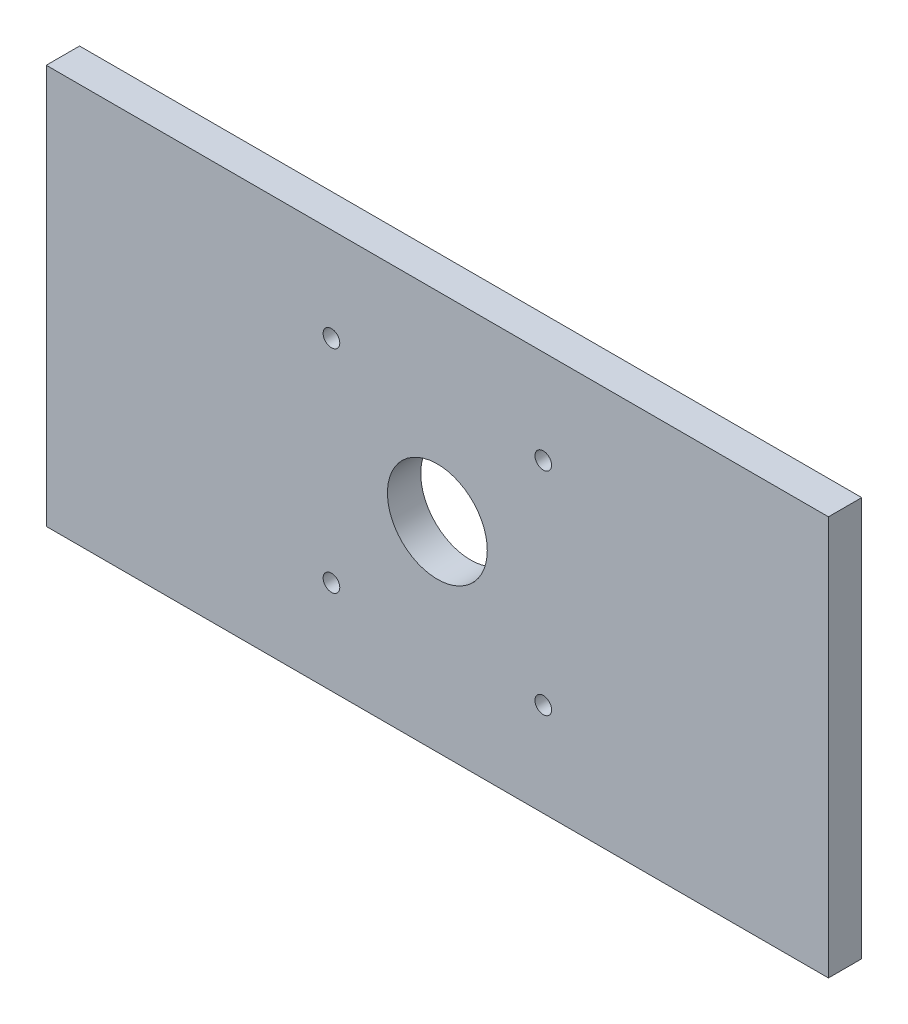
ISO-10303-21;
HEADER;
FILE_DESCRIPTION(('STEP AP214'),'2;1');
FILE_NAME('part.step','',(''),(''),'','','');
FILE_SCHEMA(('AUTOMOTIVE_DESIGN { 1 0 10303 214 1 1 1 1 }'));
ENDSEC;
DATA;
#1=APPLICATION_CONTEXT('core data for automotive mechanical design processes');
#2=APPLICATION_PROTOCOL_DEFINITION('international standard','automotive_design',2000,#1);
#3=PRODUCT_CONTEXT('',#1,'mechanical');
#4=PRODUCT('Part','Part','',(#3));
#5=PRODUCT_RELATED_PRODUCT_CATEGORY('part','',(#4));
#6=PRODUCT_DEFINITION_FORMATION('','',#4);
#7=PRODUCT_DEFINITION_CONTEXT('part definition',#1,'design');
#8=PRODUCT_DEFINITION('design','',#6,#7);
#9=PRODUCT_DEFINITION_SHAPE('','',#8);
#10=(LENGTH_UNIT() NAMED_UNIT(*) SI_UNIT(.MILLI.,.METRE.));
#11=(NAMED_UNIT(*) PLANE_ANGLE_UNIT() SI_UNIT($,.RADIAN.));
#12=(NAMED_UNIT(*) SI_UNIT($,.STERADIAN.) SOLID_ANGLE_UNIT());
#13=UNCERTAINTY_MEASURE_WITH_UNIT(LENGTH_MEASURE(1.E-05),#10,'distance_accuracy_value','');
#14=(GEOMETRIC_REPRESENTATION_CONTEXT(3) GLOBAL_UNCERTAINTY_ASSIGNED_CONTEXT((#13)) GLOBAL_UNIT_ASSIGNED_CONTEXT((#10,
#11,#12)) REPRESENTATION_CONTEXT('',''));
#15=CARTESIAN_POINT('',(0.,0.,0.));
#16=DIRECTION('',(0.,0.,1.));
#17=DIRECTION('',(1.,0.,0.));
#18=AXIS2_PLACEMENT_3D('',#15,#16,#17);
#19=CARTESIAN_POINT('',(117.5,-60.,10.));
#20=DIRECTION('',(-1.,0.,0.));
#21=DIRECTION('',(0.,0.,1.));
#22=AXIS2_PLACEMENT_3D('',#19,#20,#21);
#23=PLANE('',#22);
#24=DIRECTION('',(0.,1.,0.));
#25=VECTOR('',#24,1.);
#26=CARTESIAN_POINT('',(117.5,-60.,0.));
#27=LINE('',#26,#25);
#28=CARTESIAN_POINT('',(117.5,-60.,0.));
#29=VERTEX_POINT('',#28);
#30=CARTESIAN_POINT('',(117.5,60.,0.));
#31=VERTEX_POINT('',#30);
#32=EDGE_CURVE('E106',#29,#31,#27,.T.);
#33=ORIENTED_EDGE('',*,*,#32,.T.);
#34=DIRECTION('',(0.,0.,-1.));
#35=VECTOR('',#34,1.);
#36=CARTESIAN_POINT('',(117.5,60.,10.));
#37=LINE('',#36,#35);
#38=CARTESIAN_POINT('',(117.5,60.,10.));
#39=VERTEX_POINT('',#38);
#40=EDGE_CURVE('E11',#39,#31,#37,.T.);
#41=ORIENTED_EDGE('',*,*,#40,.F.);
#42=DIRECTION('',(0.,1.,0.));
#43=VECTOR('',#42,1.);
#44=CARTESIAN_POINT('',(117.5,-60.,10.));
#45=LINE('',#44,#43);
#46=CARTESIAN_POINT('',(117.5,-60.,10.));
#47=VERTEX_POINT('',#46);
#48=EDGE_CURVE('E90',#47,#39,#45,.T.);
#49=ORIENTED_EDGE('',*,*,#48,.F.);
#50=DIRECTION('',(0.,0.,-1.));
#51=VECTOR('',#50,1.);
#52=CARTESIAN_POINT('',(117.5,-60.,10.));
#53=LINE('',#52,#51);
#54=EDGE_CURVE('E102',#47,#29,#53,.T.);
#55=ORIENTED_EDGE('',*,*,#54,.T.);
#56=EDGE_LOOP('',(#33,#41,#49,#55));
#57=FACE_BOUND('',#56,.T.);
#58=ADVANCED_FACE('F38',(#57),#23,.F.);
#59=CARTESIAN_POINT('',(-117.5,60.,10.));
#60=DIRECTION('',(0.,-1.,0.));
#61=DIRECTION('',(0.,0.,-1.));
#62=AXIS2_PLACEMENT_3D('',#59,#60,#61);
#63=PLANE('',#62);
#64=DIRECTION('',(-1.,0.,0.));
#65=VECTOR('',#64,1.);
#66=CARTESIAN_POINT('',(-117.5,60.,0.));
#67=LINE('',#66,#65);
#68=CARTESIAN_POINT('',(-117.5,60.,0.));
#69=VERTEX_POINT('',#68);
#70=EDGE_CURVE('E95',#31,#69,#67,.T.);
#71=ORIENTED_EDGE('',*,*,#70,.T.);
#72=DIRECTION('',(0.,0.,-1.));
#73=VECTOR('',#72,1.);
#74=CARTESIAN_POINT('',(-117.5,60.,10.));
#75=LINE('',#74,#73);
#76=CARTESIAN_POINT('',(-117.5,60.,10.));
#77=VERTEX_POINT('',#76);
#78=EDGE_CURVE('E47',#77,#69,#75,.T.);
#79=ORIENTED_EDGE('',*,*,#78,.F.);
#80=DIRECTION('',(-1.,0.,0.));
#81=VECTOR('',#80,1.);
#82=CARTESIAN_POINT('',(-117.5,60.,10.));
#83=LINE('',#82,#81);
#84=EDGE_CURVE('E85',#39,#77,#83,.T.);
#85=ORIENTED_EDGE('',*,*,#84,.F.);
#86=ORIENTED_EDGE('',*,*,#40,.T.);
#87=EDGE_LOOP('',(#71,#79,#85,#86));
#88=FACE_BOUND('',#87,.T.);
#89=ADVANCED_FACE('F94',(#88),#63,.F.);
#90=CARTESIAN_POINT('',(-117.5,-60.,10.));
#91=DIRECTION('',(1.,0.,0.));
#92=DIRECTION('',(0.,0.,-1.));
#93=AXIS2_PLACEMENT_3D('',#90,#91,#92);
#94=PLANE('',#93);
#95=DIRECTION('',(0.,-1.,0.));
#96=VECTOR('',#95,1.);
#97=CARTESIAN_POINT('',(-117.5,-60.,0.));
#98=LINE('',#97,#96);
#99=CARTESIAN_POINT('',(-117.5,-60.,0.));
#100=VERTEX_POINT('',#99);
#101=EDGE_CURVE('E72',#69,#100,#98,.T.);
#102=ORIENTED_EDGE('',*,*,#101,.T.);
#103=DIRECTION('',(0.,0.,-1.));
#104=VECTOR('',#103,1.);
#105=CARTESIAN_POINT('',(-117.5,-60.,10.));
#106=LINE('',#105,#104);
#107=CARTESIAN_POINT('',(-117.5,-60.,10.));
#108=VERTEX_POINT('',#107);
#109=EDGE_CURVE('E97',#108,#100,#106,.T.);
#110=ORIENTED_EDGE('',*,*,#109,.F.);
#111=DIRECTION('',(0.,-1.,0.));
#112=VECTOR('',#111,1.);
#113=CARTESIAN_POINT('',(-117.5,-60.,10.));
#114=LINE('',#113,#112);
#115=EDGE_CURVE('E88',#77,#108,#114,.T.);
#116=ORIENTED_EDGE('',*,*,#115,.F.);
#117=ORIENTED_EDGE('',*,*,#78,.T.);
#118=EDGE_LOOP('',(#102,#110,#116,#117));
#119=FACE_BOUND('',#118,.T.);
#120=ADVANCED_FACE('F98',(#119),#94,.F.);
#121=CARTESIAN_POINT('',(-117.5,-60.,10.));
#122=DIRECTION('',(0.,1.,0.));
#123=DIRECTION('',(0.,0.,1.));
#124=AXIS2_PLACEMENT_3D('',#121,#122,#123);
#125=PLANE('',#124);
#126=DIRECTION('',(1.,0.,0.));
#127=VECTOR('',#126,1.);
#128=CARTESIAN_POINT('',(-117.5,-60.,0.));
#129=LINE('',#128,#127);
#130=EDGE_CURVE('E78',#100,#29,#129,.T.);
#131=ORIENTED_EDGE('',*,*,#130,.T.);
#132=ORIENTED_EDGE('',*,*,#54,.F.);
#133=DIRECTION('',(1.,0.,0.));
#134=VECTOR('',#133,1.);
#135=CARTESIAN_POINT('',(-117.5,-60.,10.));
#136=LINE('',#135,#134);
#137=EDGE_CURVE('E55',#108,#47,#136,.T.);
#138=ORIENTED_EDGE('',*,*,#137,.F.);
#139=ORIENTED_EDGE('',*,*,#109,.T.);
#140=EDGE_LOOP('',(#131,#132,#138,#139));
#141=FACE_BOUND('',#140,.T.);
#142=ADVANCED_FACE('F120',(#141),#125,.F.);
#143=CARTESIAN_POINT('',(0.,0.,10.));
#144=DIRECTION('',(0.,0.,-1.));
#145=DIRECTION('',(-1.,0.,0.));
#146=AXIS2_PLACEMENT_3D('',#143,#144,#145);
#147=PLANE('',#146);
#148=CARTESIAN_POINT('',(-31.8198051533935,31.8198051533919,10.));
#149=DIRECTION('',(0.,0.,1.));
#150=DIRECTION('',(1.,0.,0.));
#151=AXIS2_PLACEMENT_3D('',#148,#149,#150);
#152=CIRCLE('',#151,2.5);
#153=CARTESIAN_POINT('',(-29.3198051533935,31.8198051533919,10.));
#154=VERTEX_POINT('',#153);
#155=EDGE_CURVE('E143',#154,#154,#152,.T.);
#156=ORIENTED_EDGE('',*,*,#155,.F.);
#157=EDGE_LOOP('',(#156));
#158=FACE_BOUND('',#157,.T.);
#159=CARTESIAN_POINT('',(-31.8198051533881,-31.8198051533974,10.));
#160=DIRECTION('',(0.,0.,1.));
#161=DIRECTION('',(1.,0.,0.));
#162=AXIS2_PLACEMENT_3D('',#159,#160,#161);
#163=CIRCLE('',#162,2.5);
#164=CARTESIAN_POINT('',(-29.3198051533881,-31.8198051533974,10.));
#165=VERTEX_POINT('',#164);
#166=EDGE_CURVE('E151',#165,#165,#163,.T.);
#167=ORIENTED_EDGE('',*,*,#166,.F.);
#168=EDGE_LOOP('',(#167));
#169=FACE_BOUND('',#168,.T.);
#170=CARTESIAN_POINT('',(31.8198051534012,-31.8198051533919,10.));
#171=DIRECTION('',(0.,0.,1.));
#172=DIRECTION('',(1.,0.,0.));
#173=AXIS2_PLACEMENT_3D('',#170,#171,#172);
#174=CIRCLE('',#173,2.5);
#175=CARTESIAN_POINT('',(34.3198051534012,-31.8198051533919,10.));
#176=VERTEX_POINT('',#175);
#177=EDGE_CURVE('E159',#176,#176,#174,.T.);
#178=ORIENTED_EDGE('',*,*,#177,.F.);
#179=EDGE_LOOP('',(#178));
#180=FACE_BOUND('',#179,.T.);
#181=CARTESIAN_POINT('',(31.8198051533958,31.8198051533974,10.));
#182=DIRECTION('',(0.,0.,1.));
#183=DIRECTION('',(1.,0.,0.));
#184=AXIS2_PLACEMENT_3D('',#181,#182,#183);
#185=CIRCLE('',#184,2.5);
#186=CARTESIAN_POINT('',(34.3198051533958,31.8198051533974,10.));
#187=VERTEX_POINT('',#186);
#188=EDGE_CURVE('E135',#187,#187,#185,.T.);
#189=ORIENTED_EDGE('',*,*,#188,.F.);
#190=EDGE_LOOP('',(#189));
#191=FACE_BOUND('',#190,.T.);
#192=CARTESIAN_POINT('',(0.,0.,10.));
#193=DIRECTION('',(0.,0.,1.));
#194=DIRECTION('',(1.,0.,0.));
#195=AXIS2_PLACEMENT_3D('',#192,#193,#194);
#196=CIRCLE('',#195,15.);
#197=CARTESIAN_POINT('',(15.,0.,10.));
#198=VERTEX_POINT('',#197);
#199=EDGE_CURVE('E127',#198,#198,#196,.T.);
#200=ORIENTED_EDGE('',*,*,#199,.F.);
#201=EDGE_LOOP('',(#200));
#202=FACE_BOUND('',#201,.T.);
#203=ORIENTED_EDGE('',*,*,#48,.T.);
#204=ORIENTED_EDGE('',*,*,#84,.T.);
#205=ORIENTED_EDGE('',*,*,#115,.T.);
#206=ORIENTED_EDGE('',*,*,#137,.T.);
#207=EDGE_LOOP('',(#203,#204,#205,#206));
#208=FACE_BOUND('',#207,.T.);
#209=ADVANCED_FACE('F86',(#158,#169,#180,#191,#202,#208),#147,.F.);
#210=CARTESIAN_POINT('',(0.,0.,0.));
#211=DIRECTION('',(0.,0.,-1.));
#212=DIRECTION('',(-1.,0.,0.));
#213=AXIS2_PLACEMENT_3D('',#210,#211,#212);
#214=PLANE('',#213);
#215=CARTESIAN_POINT('',(-31.8198051533935,31.8198051533919,0.));
#216=DIRECTION('',(0.,0.,1.));
#217=DIRECTION('',(1.,0.,0.));
#218=AXIS2_PLACEMENT_3D('',#215,#216,#217);
#219=CIRCLE('',#218,2.5);
#220=CARTESIAN_POINT('',(-29.3198051533935,31.8198051533919,0.));
#221=VERTEX_POINT('',#220);
#222=EDGE_CURVE('E147',#221,#221,#219,.T.);
#223=ORIENTED_EDGE('',*,*,#222,.T.);
#224=EDGE_LOOP('',(#223));
#225=FACE_BOUND('',#224,.T.);
#226=CARTESIAN_POINT('',(-31.8198051533881,-31.8198051533974,0.));
#227=DIRECTION('',(0.,0.,1.));
#228=DIRECTION('',(1.,0.,0.));
#229=AXIS2_PLACEMENT_3D('',#226,#227,#228);
#230=CIRCLE('',#229,2.5);
#231=CARTESIAN_POINT('',(-29.3198051533881,-31.8198051533974,0.));
#232=VERTEX_POINT('',#231);
#233=EDGE_CURVE('E155',#232,#232,#230,.T.);
#234=ORIENTED_EDGE('',*,*,#233,.T.);
#235=EDGE_LOOP('',(#234));
#236=FACE_BOUND('',#235,.T.);
#237=CARTESIAN_POINT('',(31.8198051534012,-31.8198051533919,0.));
#238=DIRECTION('',(0.,0.,1.));
#239=DIRECTION('',(1.,0.,0.));
#240=AXIS2_PLACEMENT_3D('',#237,#238,#239);
#241=CIRCLE('',#240,2.5);
#242=CARTESIAN_POINT('',(34.3198051534012,-31.8198051533919,0.));
#243=VERTEX_POINT('',#242);
#244=EDGE_CURVE('E139',#243,#243,#241,.T.);
#245=ORIENTED_EDGE('',*,*,#244,.T.);
#246=EDGE_LOOP('',(#245));
#247=FACE_BOUND('',#246,.T.);
#248=CARTESIAN_POINT('',(31.8198051533958,31.8198051533974,0.));
#249=DIRECTION('',(0.,0.,1.));
#250=DIRECTION('',(1.,0.,0.));
#251=AXIS2_PLACEMENT_3D('',#248,#249,#250);
#252=CIRCLE('',#251,2.5);
#253=CARTESIAN_POINT('',(34.3198051533958,31.8198051533974,0.));
#254=VERTEX_POINT('',#253);
#255=EDGE_CURVE('E131',#254,#254,#252,.T.);
#256=ORIENTED_EDGE('',*,*,#255,.T.);
#257=EDGE_LOOP('',(#256));
#258=FACE_BOUND('',#257,.T.);
#259=CARTESIAN_POINT('',(0.,0.,0.));
#260=DIRECTION('',(0.,0.,1.));
#261=DIRECTION('',(1.,0.,0.));
#262=AXIS2_PLACEMENT_3D('',#259,#260,#261);
#263=CIRCLE('',#262,15.);
#264=CARTESIAN_POINT('',(15.,0.,0.));
#265=VERTEX_POINT('',#264);
#266=EDGE_CURVE('E110',#265,#265,#263,.T.);
#267=ORIENTED_EDGE('',*,*,#266,.T.);
#268=EDGE_LOOP('',(#267));
#269=FACE_BOUND('',#268,.T.);
#270=ORIENTED_EDGE('',*,*,#32,.F.);
#271=ORIENTED_EDGE('',*,*,#130,.F.);
#272=ORIENTED_EDGE('',*,*,#101,.F.);
#273=ORIENTED_EDGE('',*,*,#70,.F.);
#274=EDGE_LOOP('',(#270,#271,#272,#273));
#275=FACE_BOUND('',#274,.T.);
#276=ADVANCED_FACE('F123',(#225,#236,#247,#258,#269,#275),#214,.T.);
#277=CARTESIAN_POINT('',(0.,0.,0.));
#278=DIRECTION('',(0.,0.,1.));
#279=DIRECTION('',(1.,0.,0.));
#280=AXIS2_PLACEMENT_3D('',#277,#278,#279);
#281=CYLINDRICAL_SURFACE('',#280,15.);
#282=ORIENTED_EDGE('',*,*,#266,.F.);
#283=EDGE_LOOP('',(#282));
#284=FACE_BOUND('',#283,.T.);
#285=ORIENTED_EDGE('',*,*,#199,.T.);
#286=EDGE_LOOP('',(#285));
#287=FACE_BOUND('',#286,.T.);
#288=ADVANCED_FACE('F185',(#284,#287),#281,.F.);
#289=CARTESIAN_POINT('',(31.8198051533958,31.8198051533974,0.));
#290=DIRECTION('',(0.,0.,1.));
#291=DIRECTION('',(1.,0.,0.));
#292=AXIS2_PLACEMENT_3D('',#289,#290,#291);
#293=CYLINDRICAL_SURFACE('',#292,2.5);
#294=ORIENTED_EDGE('',*,*,#255,.F.);
#295=EDGE_LOOP('',(#294));
#296=FACE_BOUND('',#295,.T.);
#297=ORIENTED_EDGE('',*,*,#188,.T.);
#298=EDGE_LOOP('',(#297));
#299=FACE_BOUND('',#298,.T.);
#300=ADVANCED_FACE('F173',(#296,#299),#293,.F.);
#301=CARTESIAN_POINT('',(31.8198051534012,-31.8198051533919,0.));
#302=DIRECTION('',(0.,0.,1.));
#303=DIRECTION('',(1.,0.,0.));
#304=AXIS2_PLACEMENT_3D('',#301,#302,#303);
#305=CYLINDRICAL_SURFACE('',#304,2.5);
#306=ORIENTED_EDGE('',*,*,#244,.F.);
#307=EDGE_LOOP('',(#306));
#308=FACE_BOUND('',#307,.T.);
#309=ORIENTED_EDGE('',*,*,#177,.T.);
#310=EDGE_LOOP('',(#309));
#311=FACE_BOUND('',#310,.T.);
#312=ADVANCED_FACE('F169',(#308,#311),#305,.F.);
#313=CARTESIAN_POINT('',(-31.8198051533881,-31.8198051533974,0.));
#314=DIRECTION('',(0.,0.,1.));
#315=DIRECTION('',(1.,0.,0.));
#316=AXIS2_PLACEMENT_3D('',#313,#314,#315);
#317=CYLINDRICAL_SURFACE('',#316,2.5);
#318=ORIENTED_EDGE('',*,*,#233,.F.);
#319=EDGE_LOOP('',(#318));
#320=FACE_BOUND('',#319,.T.);
#321=ORIENTED_EDGE('',*,*,#166,.T.);
#322=EDGE_LOOP('',(#321));
#323=FACE_BOUND('',#322,.T.);
#324=ADVANCED_FACE('F172',(#320,#323),#317,.F.);
#325=CARTESIAN_POINT('',(-31.8198051533935,31.8198051533919,0.));
#326=DIRECTION('',(0.,0.,1.));
#327=DIRECTION('',(1.,0.,0.));
#328=AXIS2_PLACEMENT_3D('',#325,#326,#327);
#329=CYLINDRICAL_SURFACE('',#328,2.5);
#330=ORIENTED_EDGE('',*,*,#222,.F.);
#331=EDGE_LOOP('',(#330));
#332=FACE_BOUND('',#331,.T.);
#333=ORIENTED_EDGE('',*,*,#155,.T.);
#334=EDGE_LOOP('',(#333));
#335=FACE_BOUND('',#334,.T.);
#336=ADVANCED_FACE('F244',(#332,#335),#329,.F.);
#337=CLOSED_SHELL('',(#58,#89,#120,#142,#209,#276,#288,#300,#312,#324,#336));
#338=MANIFOLD_SOLID_BREP('B2',#337);
#339=ADVANCED_BREP_SHAPE_REPRESENTATION('',(#18,#338),#14);
#340=SHAPE_DEFINITION_REPRESENTATION(#9,#339);
ENDSEC;
END-ISO-10303-21;
